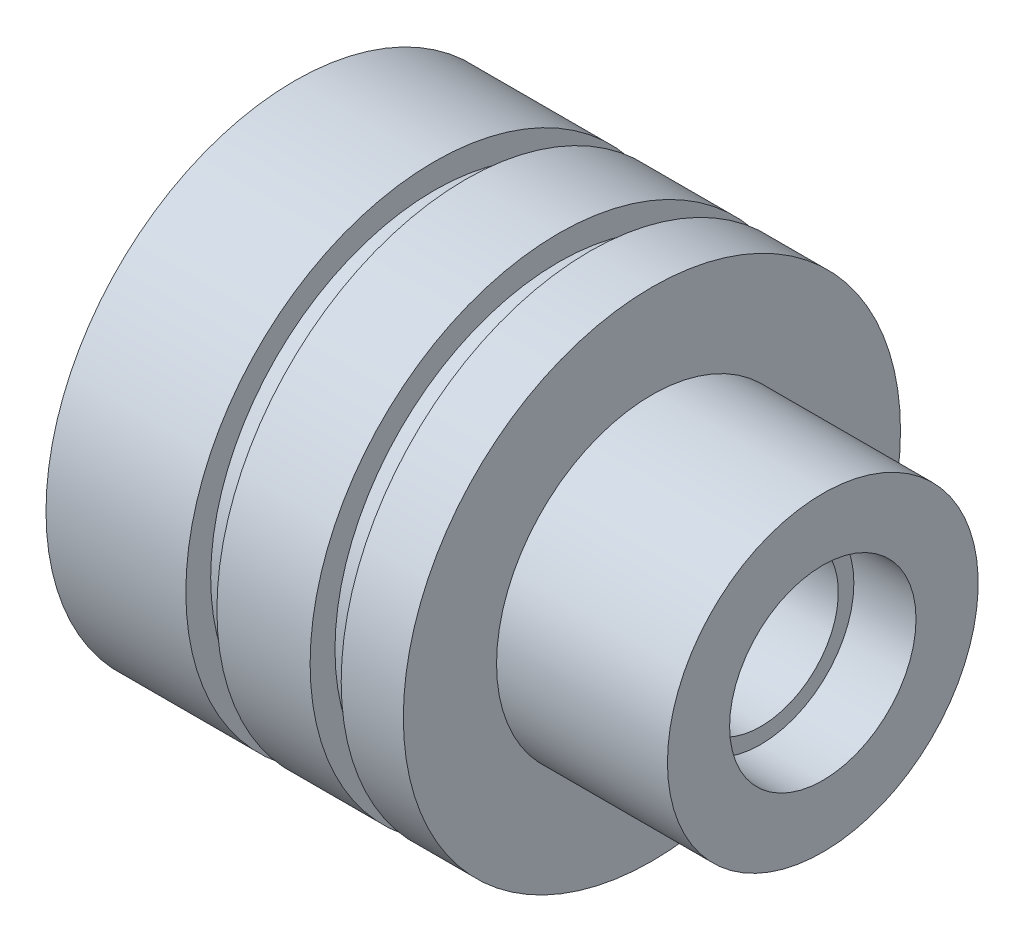
ISO-10303-21;
HEADER;
FILE_DESCRIPTION(('STEP AP214'),'2;1');
FILE_NAME('part.step','',(''),(''),'','','');
FILE_SCHEMA(('AUTOMOTIVE_DESIGN { 1 0 10303 214 1 1 1 1 }'));
ENDSEC;
DATA;
#1=APPLICATION_CONTEXT('core data for automotive mechanical design processes');
#2=APPLICATION_PROTOCOL_DEFINITION('international standard','automotive_design',2000,#1);
#3=PRODUCT_CONTEXT('',#1,'mechanical');
#4=PRODUCT('Part','Part','',(#3));
#5=PRODUCT_RELATED_PRODUCT_CATEGORY('part','',(#4));
#6=PRODUCT_DEFINITION_FORMATION('','',#4);
#7=PRODUCT_DEFINITION_CONTEXT('part definition',#1,'design');
#8=PRODUCT_DEFINITION('design','',#6,#7);
#9=PRODUCT_DEFINITION_SHAPE('','',#8);
#10=(LENGTH_UNIT() NAMED_UNIT(*) SI_UNIT(.MILLI.,.METRE.));
#11=(NAMED_UNIT(*) PLANE_ANGLE_UNIT() SI_UNIT($,.RADIAN.));
#12=(NAMED_UNIT(*) SI_UNIT($,.STERADIAN.) SOLID_ANGLE_UNIT());
#13=UNCERTAINTY_MEASURE_WITH_UNIT(LENGTH_MEASURE(1.E-05),#10,'distance_accuracy_value','');
#14=(GEOMETRIC_REPRESENTATION_CONTEXT(3) GLOBAL_UNCERTAINTY_ASSIGNED_CONTEXT((#13)) GLOBAL_UNIT_ASSIGNED_CONTEXT((#10,
#11,#12)) REPRESENTATION_CONTEXT('',''));
#15=CARTESIAN_POINT('',(0.,0.,0.));
#16=DIRECTION('',(0.,0.,1.));
#17=DIRECTION('',(1.,0.,0.));
#18=AXIS2_PLACEMENT_3D('',#15,#16,#17);
#19=CARTESIAN_POINT('',(15.,2.5,0.));
#20=DIRECTION('',(-1.,0.,0.));
#21=DIRECTION('',(0.,0.,1.));
#22=AXIS2_PLACEMENT_3D('',#19,#20,#21);
#23=PLANE('',#22);
#24=CARTESIAN_POINT('',(15.,0.,0.));
#25=DIRECTION('',(-1.,0.,0.));
#26=DIRECTION('',(0.,0.,1.));
#27=AXIS2_PLACEMENT_3D('',#24,#25,#26);
#28=CIRCLE('',#27,3.);
#29=CARTESIAN_POINT('',(15.,0.,3.));
#30=VERTEX_POINT('',#29);
#31=EDGE_CURVE('E92',#30,#30,#28,.T.);
#32=ORIENTED_EDGE('',*,*,#31,.F.);
#33=EDGE_LOOP('',(#32));
#34=FACE_BOUND('',#33,.T.);
#35=CARTESIAN_POINT('',(15.,0.,0.));
#36=DIRECTION('',(-1.,0.,0.));
#37=DIRECTION('',(0.,0.,1.));
#38=AXIS2_PLACEMENT_3D('',#35,#36,#37);
#39=CIRCLE('',#38,2.5);
#40=CARTESIAN_POINT('',(15.,0.,2.5));
#41=VERTEX_POINT('',#40);
#42=EDGE_CURVE('E12',#41,#41,#39,.T.);
#43=ORIENTED_EDGE('',*,*,#42,.T.);
#44=EDGE_LOOP('',(#43));
#45=FACE_BOUND('',#44,.T.);
#46=ADVANCED_FACE('F40',(#34,#45),#23,.F.);
#47=CARTESIAN_POINT('',(0.,0.,0.));
#48=DIRECTION('',(-1.,0.,0.));
#49=DIRECTION('',(0.,0.,1.));
#50=AXIS2_PLACEMENT_3D('',#47,#48,#49);
#51=CYLINDRICAL_SURFACE('',#50,2.5);
#52=ORIENTED_EDGE('',*,*,#42,.F.);
#53=EDGE_LOOP('',(#52));
#54=FACE_BOUND('',#53,.T.);
#55=CARTESIAN_POINT('',(0.,0.,0.));
#56=DIRECTION('',(-1.,0.,0.));
#57=DIRECTION('',(0.,0.,1.));
#58=AXIS2_PLACEMENT_3D('',#55,#56,#57);
#59=CIRCLE('',#58,2.5);
#60=CARTESIAN_POINT('',(0.,0.,2.5));
#61=VERTEX_POINT('',#60);
#62=EDGE_CURVE('E46',#61,#61,#59,.T.);
#63=ORIENTED_EDGE('',*,*,#62,.T.);
#64=EDGE_LOOP('',(#63));
#65=FACE_BOUND('',#64,.T.);
#66=ADVANCED_FACE('F99',(#54,#65),#51,.F.);
#67=CARTESIAN_POINT('',(0.,8.,0.));
#68=DIRECTION('',(1.,0.,0.));
#69=DIRECTION('',(0.,0.,-1.));
#70=AXIS2_PLACEMENT_3D('',#67,#68,#69);
#71=PLANE('',#70);
#72=ORIENTED_EDGE('',*,*,#62,.F.);
#73=EDGE_LOOP('',(#72));
#74=FACE_BOUND('',#73,.T.);
#75=CARTESIAN_POINT('',(0.,0.,0.));
#76=DIRECTION('',(-1.,0.,0.));
#77=DIRECTION('',(0.,0.,1.));
#78=AXIS2_PLACEMENT_3D('',#75,#76,#77);
#79=CIRCLE('',#78,8.);
#80=CARTESIAN_POINT('',(0.,0.,8.));
#81=VERTEX_POINT('',#80);
#82=EDGE_CURVE('E50',#81,#81,#79,.T.);
#83=ORIENTED_EDGE('',*,*,#82,.T.);
#84=EDGE_LOOP('',(#83));
#85=FACE_BOUND('',#84,.T.);
#86=ADVANCED_FACE('F103',(#74,#85),#71,.F.);
#87=CARTESIAN_POINT('',(0.,0.,0.));
#88=DIRECTION('',(-1.,0.,0.));
#89=DIRECTION('',(0.,0.,1.));
#90=AXIS2_PLACEMENT_3D('',#87,#88,#89);
#91=CYLINDRICAL_SURFACE('',#90,8.);
#92=ORIENTED_EDGE('',*,*,#82,.F.);
#93=EDGE_LOOP('',(#92));
#94=FACE_BOUND('',#93,.T.);
#95=CARTESIAN_POINT('',(4.5,0.,0.));
#96=DIRECTION('',(-1.,0.,0.));
#97=DIRECTION('',(0.,0.,1.));
#98=AXIS2_PLACEMENT_3D('',#95,#96,#97);
#99=CIRCLE('',#98,8.);
#100=CARTESIAN_POINT('',(4.5,0.,8.));
#101=VERTEX_POINT('',#100);
#102=EDGE_CURVE('E54',#101,#101,#99,.T.);
#103=ORIENTED_EDGE('',*,*,#102,.T.);
#104=EDGE_LOOP('',(#103));
#105=FACE_BOUND('',#104,.T.);
#106=ADVANCED_FACE('F108',(#94,#105),#91,.T.);
#107=CARTESIAN_POINT('',(4.5,8.,0.));
#108=DIRECTION('',(-1.,0.,0.));
#109=DIRECTION('',(0.,0.,1.));
#110=AXIS2_PLACEMENT_3D('',#107,#108,#109);
#111=PLANE('',#110);
#112=ORIENTED_EDGE('',*,*,#102,.F.);
#113=EDGE_LOOP('',(#112));
#114=FACE_BOUND('',#113,.T.);
#115=CARTESIAN_POINT('',(4.5,0.,0.));
#116=DIRECTION('',(-1.,0.,0.));
#117=DIRECTION('',(0.,0.,1.));
#118=AXIS2_PLACEMENT_3D('',#115,#116,#117);
#119=CIRCLE('',#118,7.2);
#120=CARTESIAN_POINT('',(4.5,0.,7.2));
#121=VERTEX_POINT('',#120);
#122=EDGE_CURVE('E59',#121,#121,#119,.T.);
#123=ORIENTED_EDGE('',*,*,#122,.T.);
#124=EDGE_LOOP('',(#123));
#125=FACE_BOUND('',#124,.T.);
#126=ADVANCED_FACE('F114',(#114,#125),#111,.F.);
#127=CARTESIAN_POINT('',(0.,0.,0.));
#128=DIRECTION('',(-1.,0.,0.));
#129=DIRECTION('',(0.,0.,1.));
#130=AXIS2_PLACEMENT_3D('',#127,#128,#129);
#131=CYLINDRICAL_SURFACE('',#130,7.2);
#132=ORIENTED_EDGE('',*,*,#122,.F.);
#133=EDGE_LOOP('',(#132));
#134=FACE_BOUND('',#133,.T.);
#135=CARTESIAN_POINT('',(5.5,0.,0.));
#136=DIRECTION('',(-1.,0.,0.));
#137=DIRECTION('',(0.,0.,1.));
#138=AXIS2_PLACEMENT_3D('',#135,#136,#137);
#139=CIRCLE('',#138,7.2);
#140=CARTESIAN_POINT('',(5.5,0.,7.2));
#141=VERTEX_POINT('',#140);
#142=EDGE_CURVE('E62',#141,#141,#139,.T.);
#143=ORIENTED_EDGE('',*,*,#142,.T.);
#144=EDGE_LOOP('',(#143));
#145=FACE_BOUND('',#144,.T.);
#146=ADVANCED_FACE('F118',(#134,#145),#131,.T.);
#147=CARTESIAN_POINT('',(5.5,7.2,0.));
#148=DIRECTION('',(1.,0.,0.));
#149=DIRECTION('',(0.,0.,-1.));
#150=AXIS2_PLACEMENT_3D('',#147,#148,#149);
#151=PLANE('',#150);
#152=ORIENTED_EDGE('',*,*,#142,.F.);
#153=EDGE_LOOP('',(#152));
#154=FACE_BOUND('',#153,.T.);
#155=CARTESIAN_POINT('',(5.5,0.,0.));
#156=DIRECTION('',(-1.,0.,0.));
#157=DIRECTION('',(0.,0.,1.));
#158=AXIS2_PLACEMENT_3D('',#155,#156,#157);
#159=CIRCLE('',#158,8.);
#160=CARTESIAN_POINT('',(5.5,0.,8.));
#161=VERTEX_POINT('',#160);
#162=EDGE_CURVE('E65',#161,#161,#159,.T.);
#163=ORIENTED_EDGE('',*,*,#162,.T.);
#164=EDGE_LOOP('',(#163));
#165=FACE_BOUND('',#164,.T.);
#166=ADVANCED_FACE('F122',(#154,#165),#151,.F.);
#167=CARTESIAN_POINT('',(0.,0.,0.));
#168=DIRECTION('',(-1.,0.,0.));
#169=DIRECTION('',(0.,0.,1.));
#170=AXIS2_PLACEMENT_3D('',#167,#168,#169);
#171=CYLINDRICAL_SURFACE('',#170,8.);
#172=ORIENTED_EDGE('',*,*,#162,.F.);
#173=EDGE_LOOP('',(#172));
#174=FACE_BOUND('',#173,.T.);
#175=CARTESIAN_POINT('',(8.5,0.,0.));
#176=DIRECTION('',(-1.,0.,0.));
#177=DIRECTION('',(0.,0.,1.));
#178=AXIS2_PLACEMENT_3D('',#175,#176,#177);
#179=CIRCLE('',#178,8.);
#180=CARTESIAN_POINT('',(8.5,0.,8.));
#181=VERTEX_POINT('',#180);
#182=EDGE_CURVE('E68',#181,#181,#179,.T.);
#183=ORIENTED_EDGE('',*,*,#182,.T.);
#184=EDGE_LOOP('',(#183));
#185=FACE_BOUND('',#184,.T.);
#186=ADVANCED_FACE('F126',(#174,#185),#171,.T.);
#187=CARTESIAN_POINT('',(8.5,8.,0.));
#188=DIRECTION('',(-1.,0.,0.));
#189=DIRECTION('',(0.,0.,1.));
#190=AXIS2_PLACEMENT_3D('',#187,#188,#189);
#191=PLANE('',#190);
#192=ORIENTED_EDGE('',*,*,#182,.F.);
#193=EDGE_LOOP('',(#192));
#194=FACE_BOUND('',#193,.T.);
#195=CARTESIAN_POINT('',(8.5,0.,0.));
#196=DIRECTION('',(-1.,0.,0.));
#197=DIRECTION('',(0.,0.,1.));
#198=AXIS2_PLACEMENT_3D('',#195,#196,#197);
#199=CIRCLE('',#198,7.2);
#200=CARTESIAN_POINT('',(8.5,0.,7.2));
#201=VERTEX_POINT('',#200);
#202=EDGE_CURVE('E71',#201,#201,#199,.T.);
#203=ORIENTED_EDGE('',*,*,#202,.T.);
#204=EDGE_LOOP('',(#203));
#205=FACE_BOUND('',#204,.T.);
#206=ADVANCED_FACE('F130',(#194,#205),#191,.F.);
#207=CARTESIAN_POINT('',(0.,0.,0.));
#208=DIRECTION('',(-1.,0.,0.));
#209=DIRECTION('',(0.,0.,1.));
#210=AXIS2_PLACEMENT_3D('',#207,#208,#209);
#211=CYLINDRICAL_SURFACE('',#210,7.2);
#212=ORIENTED_EDGE('',*,*,#202,.F.);
#213=EDGE_LOOP('',(#212));
#214=FACE_BOUND('',#213,.T.);
#215=CARTESIAN_POINT('',(9.5,0.,0.));
#216=DIRECTION('',(-1.,0.,0.));
#217=DIRECTION('',(0.,0.,1.));
#218=AXIS2_PLACEMENT_3D('',#215,#216,#217);
#219=CIRCLE('',#218,7.2);
#220=CARTESIAN_POINT('',(9.5,0.,7.2));
#221=VERTEX_POINT('',#220);
#222=EDGE_CURVE('E74',#221,#221,#219,.T.);
#223=ORIENTED_EDGE('',*,*,#222,.T.);
#224=EDGE_LOOP('',(#223));
#225=FACE_BOUND('',#224,.T.);
#226=ADVANCED_FACE('F134',(#214,#225),#211,.T.);
#227=CARTESIAN_POINT('',(9.5,7.2,0.));
#228=DIRECTION('',(1.,0.,0.));
#229=DIRECTION('',(0.,0.,-1.));
#230=AXIS2_PLACEMENT_3D('',#227,#228,#229);
#231=PLANE('',#230);
#232=ORIENTED_EDGE('',*,*,#222,.F.);
#233=EDGE_LOOP('',(#232));
#234=FACE_BOUND('',#233,.T.);
#235=CARTESIAN_POINT('',(9.5,0.,0.));
#236=DIRECTION('',(-1.,0.,0.));
#237=DIRECTION('',(0.,0.,1.));
#238=AXIS2_PLACEMENT_3D('',#235,#236,#237);
#239=CIRCLE('',#238,8.);
#240=CARTESIAN_POINT('',(9.5,0.,8.));
#241=VERTEX_POINT('',#240);
#242=EDGE_CURVE('E77',#241,#241,#239,.T.);
#243=ORIENTED_EDGE('',*,*,#242,.T.);
#244=EDGE_LOOP('',(#243));
#245=FACE_BOUND('',#244,.T.);
#246=ADVANCED_FACE('F138',(#234,#245),#231,.F.);
#247=CARTESIAN_POINT('',(0.,0.,0.));
#248=DIRECTION('',(-1.,0.,0.));
#249=DIRECTION('',(0.,0.,1.));
#250=AXIS2_PLACEMENT_3D('',#247,#248,#249);
#251=CYLINDRICAL_SURFACE('',#250,8.);
#252=ORIENTED_EDGE('',*,*,#242,.F.);
#253=EDGE_LOOP('',(#252));
#254=FACE_BOUND('',#253,.T.);
#255=CARTESIAN_POINT('',(11.5,0.,0.));
#256=DIRECTION('',(-1.,0.,0.));
#257=DIRECTION('',(0.,0.,1.));
#258=AXIS2_PLACEMENT_3D('',#255,#256,#257);
#259=CIRCLE('',#258,8.);
#260=CARTESIAN_POINT('',(11.5,0.,8.));
#261=VERTEX_POINT('',#260);
#262=EDGE_CURVE('E80',#261,#261,#259,.T.);
#263=ORIENTED_EDGE('',*,*,#262,.T.);
#264=EDGE_LOOP('',(#263));
#265=FACE_BOUND('',#264,.T.);
#266=ADVANCED_FACE('F142',(#254,#265),#251,.T.);
#267=CARTESIAN_POINT('',(11.5,5.,0.));
#268=DIRECTION('',(-1.,0.,0.));
#269=DIRECTION('',(0.,0.,1.));
#270=AXIS2_PLACEMENT_3D('',#267,#268,#269);
#271=PLANE('',#270);
#272=ORIENTED_EDGE('',*,*,#262,.F.);
#273=EDGE_LOOP('',(#272));
#274=FACE_BOUND('',#273,.T.);
#275=CARTESIAN_POINT('',(11.5,0.,0.));
#276=DIRECTION('',(-1.,0.,0.));
#277=DIRECTION('',(0.,0.,1.));
#278=AXIS2_PLACEMENT_3D('',#275,#276,#277);
#279=CIRCLE('',#278,5.);
#280=CARTESIAN_POINT('',(11.5,0.,5.));
#281=VERTEX_POINT('',#280);
#282=EDGE_CURVE('E83',#281,#281,#279,.T.);
#283=ORIENTED_EDGE('',*,*,#282,.T.);
#284=EDGE_LOOP('',(#283));
#285=FACE_BOUND('',#284,.T.);
#286=ADVANCED_FACE('F146',(#274,#285),#271,.F.);
#287=CARTESIAN_POINT('',(0.,0.,0.));
#288=DIRECTION('',(-1.,0.,0.));
#289=DIRECTION('',(0.,0.,1.));
#290=AXIS2_PLACEMENT_3D('',#287,#288,#289);
#291=CYLINDRICAL_SURFACE('',#290,5.);
#292=ORIENTED_EDGE('',*,*,#282,.F.);
#293=EDGE_LOOP('',(#292));
#294=FACE_BOUND('',#293,.T.);
#295=CARTESIAN_POINT('',(17.,0.,0.));
#296=DIRECTION('',(-1.,0.,0.));
#297=DIRECTION('',(0.,0.,1.));
#298=AXIS2_PLACEMENT_3D('',#295,#296,#297);
#299=CIRCLE('',#298,5.);
#300=CARTESIAN_POINT('',(17.,0.,5.));
#301=VERTEX_POINT('',#300);
#302=EDGE_CURVE('E86',#301,#301,#299,.T.);
#303=ORIENTED_EDGE('',*,*,#302,.T.);
#304=EDGE_LOOP('',(#303));
#305=FACE_BOUND('',#304,.T.);
#306=ADVANCED_FACE('F150',(#294,#305),#291,.T.);
#307=CARTESIAN_POINT('',(17.,3.,0.));
#308=DIRECTION('',(-1.,0.,0.));
#309=DIRECTION('',(0.,0.,1.));
#310=AXIS2_PLACEMENT_3D('',#307,#308,#309);
#311=PLANE('',#310);
#312=ORIENTED_EDGE('',*,*,#302,.F.);
#313=EDGE_LOOP('',(#312));
#314=FACE_BOUND('',#313,.T.);
#315=CARTESIAN_POINT('',(17.,0.,0.));
#316=DIRECTION('',(-1.,0.,0.));
#317=DIRECTION('',(0.,0.,1.));
#318=AXIS2_PLACEMENT_3D('',#315,#316,#317);
#319=CIRCLE('',#318,3.);
#320=CARTESIAN_POINT('',(17.,0.,3.));
#321=VERTEX_POINT('',#320);
#322=EDGE_CURVE('E89',#321,#321,#319,.T.);
#323=ORIENTED_EDGE('',*,*,#322,.T.);
#324=EDGE_LOOP('',(#323));
#325=FACE_BOUND('',#324,.T.);
#326=ADVANCED_FACE('F154',(#314,#325),#311,.F.);
#327=CARTESIAN_POINT('',(0.,0.,0.));
#328=DIRECTION('',(-1.,0.,0.));
#329=DIRECTION('',(0.,0.,1.));
#330=AXIS2_PLACEMENT_3D('',#327,#328,#329);
#331=CYLINDRICAL_SURFACE('',#330,3.);
#332=ORIENTED_EDGE('',*,*,#322,.F.);
#333=EDGE_LOOP('',(#332));
#334=FACE_BOUND('',#333,.T.);
#335=ORIENTED_EDGE('',*,*,#31,.T.);
#336=EDGE_LOOP('',(#335));
#337=FACE_BOUND('',#336,.T.);
#338=ADVANCED_FACE('F96',(#334,#337),#331,.F.);
#339=CLOSED_SHELL('',(#46,#66,#86,#106,#126,#146,#166,#186,#206,#226,#246,#266,#286,#306,#326,#338));
#340=MANIFOLD_SOLID_BREP('B2',#339);
#341=ADVANCED_BREP_SHAPE_REPRESENTATION('',(#18,#340),#14);
#342=SHAPE_DEFINITION_REPRESENTATION(#9,#341);
ENDSEC;
END-ISO-10303-21;
